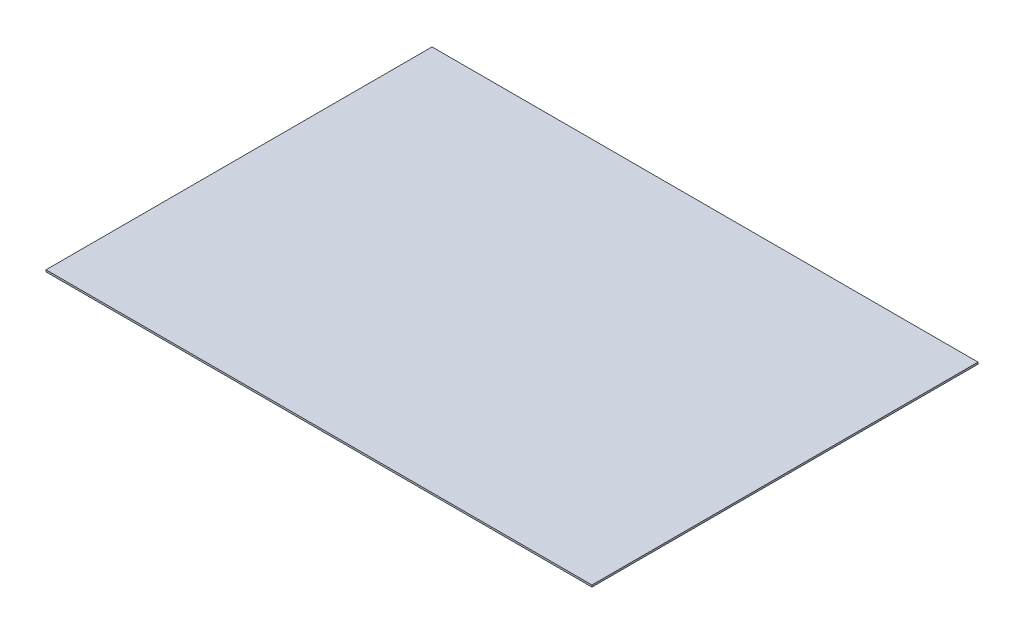
ISO-10303-21;
HEADER;
FILE_DESCRIPTION(('STEP AP214'),'2;1');
FILE_NAME('part.step','',(''),(''),'','','');
FILE_SCHEMA(('AUTOMOTIVE_DESIGN { 1 0 10303 214 1 1 1 1 }'));
ENDSEC;
DATA;
#1=APPLICATION_CONTEXT('core data for automotive mechanical design processes');
#2=APPLICATION_PROTOCOL_DEFINITION('international standard','automotive_design',2000,#1);
#3=PRODUCT_CONTEXT('',#1,'mechanical');
#4=PRODUCT('Part','Part','',(#3));
#5=PRODUCT_RELATED_PRODUCT_CATEGORY('part','',(#4));
#6=PRODUCT_DEFINITION_FORMATION('','',#4);
#7=PRODUCT_DEFINITION_CONTEXT('part definition',#1,'design');
#8=PRODUCT_DEFINITION('design','',#6,#7);
#9=PRODUCT_DEFINITION_SHAPE('','',#8);
#10=(LENGTH_UNIT() NAMED_UNIT(*) SI_UNIT(.MILLI.,.METRE.));
#11=(NAMED_UNIT(*) PLANE_ANGLE_UNIT() SI_UNIT($,.RADIAN.));
#12=(NAMED_UNIT(*) SI_UNIT($,.STERADIAN.) SOLID_ANGLE_UNIT());
#13=UNCERTAINTY_MEASURE_WITH_UNIT(LENGTH_MEASURE(1.E-05),#10,'distance_accuracy_value','');
#14=(GEOMETRIC_REPRESENTATION_CONTEXT(3) GLOBAL_UNCERTAINTY_ASSIGNED_CONTEXT((#13)) GLOBAL_UNIT_ASSIGNED_CONTEXT((#10,
#11,#12)) REPRESENTATION_CONTEXT('',''));
#15=CARTESIAN_POINT('',(0.,0.,0.));
#16=DIRECTION('',(0.,0.,1.));
#17=DIRECTION('',(1.,0.,0.));
#18=AXIS2_PLACEMENT_3D('',#15,#16,#17);
#19=CARTESIAN_POINT('',(-152.442477876106,1.,-93.0862831858407));
#20=DIRECTION('',(1.,0.,0.));
#21=DIRECTION('',(0.,0.,-1.));
#22=AXIS2_PLACEMENT_3D('',#19,#20,#21);
#23=PLANE('',#22);
#24=DIRECTION('',(0.,0.,1.));
#25=VECTOR('',#24,1.);
#26=CARTESIAN_POINT('',(-152.442477876106,0.,-93.0862831858407));
#27=LINE('',#26,#25);
#28=CARTESIAN_POINT('',(-152.442477876106,0.,-93.0862831858407));
#29=VERTEX_POINT('',#28);
#30=CARTESIAN_POINT('',(-152.442477876106,0.,116.913716814159));
#31=VERTEX_POINT('',#30);
#32=EDGE_CURVE('E95',#29,#31,#27,.T.);
#33=ORIENTED_EDGE('',*,*,#32,.T.);
#34=DIRECTION('',(0.,-1.,0.));
#35=VECTOR('',#34,1.);
#36=CARTESIAN_POINT('',(-152.442477876106,1.,116.913716814159));
#37=LINE('',#36,#35);
#38=CARTESIAN_POINT('',(-152.442477876106,1.,116.913716814159));
#39=VERTEX_POINT('',#38);
#40=EDGE_CURVE('E11',#39,#31,#37,.T.);
#41=ORIENTED_EDGE('',*,*,#40,.F.);
#42=DIRECTION('',(0.,0.,1.));
#43=VECTOR('',#42,1.);
#44=CARTESIAN_POINT('',(-152.442477876106,1.,-93.0862831858407));
#45=LINE('',#44,#43);
#46=CARTESIAN_POINT('',(-152.442477876106,1.,-93.0862831858407));
#47=VERTEX_POINT('',#46);
#48=EDGE_CURVE('E83',#47,#39,#45,.T.);
#49=ORIENTED_EDGE('',*,*,#48,.F.);
#50=DIRECTION('',(0.,-1.,0.));
#51=VECTOR('',#50,1.);
#52=CARTESIAN_POINT('',(-152.442477876106,1.,-93.0862831858407));
#53=LINE('',#52,#51);
#54=EDGE_CURVE('E91',#47,#29,#53,.T.);
#55=ORIENTED_EDGE('',*,*,#54,.T.);
#56=EDGE_LOOP('',(#33,#41,#49,#55));
#57=FACE_BOUND('',#56,.T.);
#58=ADVANCED_FACE('F32',(#57),#23,.F.);
#59=CARTESIAN_POINT('',(-152.442477876106,1.,116.913716814159));
#60=DIRECTION('',(0.,0.,-1.));
#61=DIRECTION('',(-1.,0.,0.));
#62=AXIS2_PLACEMENT_3D('',#59,#60,#61);
#63=PLANE('',#62);
#64=DIRECTION('',(1.,0.,0.));
#65=VECTOR('',#64,1.);
#66=CARTESIAN_POINT('',(-152.442477876106,0.,116.913716814159));
#67=LINE('',#66,#65);
#68=CARTESIAN_POINT('',(144.557522123894,0.,116.913716814159));
#69=VERTEX_POINT('',#68);
#70=EDGE_CURVE('E87',#31,#69,#67,.T.);
#71=ORIENTED_EDGE('',*,*,#70,.T.);
#72=DIRECTION('',(0.,-1.,0.));
#73=VECTOR('',#72,1.);
#74=CARTESIAN_POINT('',(144.557522123894,1.,116.913716814159));
#75=LINE('',#74,#73);
#76=CARTESIAN_POINT('',(144.557522123894,1.,116.913716814159));
#77=VERTEX_POINT('',#76);
#78=EDGE_CURVE('E40',#77,#69,#75,.T.);
#79=ORIENTED_EDGE('',*,*,#78,.F.);
#80=DIRECTION('',(1.,0.,0.));
#81=VECTOR('',#80,1.);
#82=CARTESIAN_POINT('',(-152.442477876106,1.,116.913716814159));
#83=LINE('',#82,#81);
#84=EDGE_CURVE('E78',#39,#77,#83,.T.);
#85=ORIENTED_EDGE('',*,*,#84,.F.);
#86=ORIENTED_EDGE('',*,*,#40,.T.);
#87=EDGE_LOOP('',(#71,#79,#85,#86));
#88=FACE_BOUND('',#87,.T.);
#89=ADVANCED_FACE('F86',(#88),#63,.F.);
#90=CARTESIAN_POINT('',(144.557522123894,1.,-93.0862831858407));
#91=DIRECTION('',(-1.,0.,0.));
#92=DIRECTION('',(0.,0.,1.));
#93=AXIS2_PLACEMENT_3D('',#90,#91,#92);
#94=PLANE('',#93);
#95=DIRECTION('',(0.,0.,-1.));
#96=VECTOR('',#95,1.);
#97=CARTESIAN_POINT('',(144.557522123894,0.,-93.0862831858407));
#98=LINE('',#97,#96);
#99=CARTESIAN_POINT('',(144.557522123894,0.,-93.0862831858407));
#100=VERTEX_POINT('',#99);
#101=EDGE_CURVE('E65',#69,#100,#98,.T.);
#102=ORIENTED_EDGE('',*,*,#101,.T.);
#103=DIRECTION('',(0.,-1.,0.));
#104=VECTOR('',#103,1.);
#105=CARTESIAN_POINT('',(144.557522123894,1.,-93.0862831858407));
#106=LINE('',#105,#104);
#107=CARTESIAN_POINT('',(144.557522123894,1.,-93.0862831858407));
#108=VERTEX_POINT('',#107);
#109=EDGE_CURVE('E88',#108,#100,#106,.T.);
#110=ORIENTED_EDGE('',*,*,#109,.F.);
#111=DIRECTION('',(0.,0.,-1.));
#112=VECTOR('',#111,1.);
#113=CARTESIAN_POINT('',(144.557522123894,1.,-93.0862831858407));
#114=LINE('',#113,#112);
#115=EDGE_CURVE('E81',#77,#108,#114,.T.);
#116=ORIENTED_EDGE('',*,*,#115,.F.);
#117=ORIENTED_EDGE('',*,*,#78,.T.);
#118=EDGE_LOOP('',(#102,#110,#116,#117));
#119=FACE_BOUND('',#118,.T.);
#120=ADVANCED_FACE('F89',(#119),#94,.F.);
#121=CARTESIAN_POINT('',(-152.442477876106,1.,-93.0862831858407));
#122=DIRECTION('',(0.,0.,1.));
#123=DIRECTION('',(1.,0.,0.));
#124=AXIS2_PLACEMENT_3D('',#121,#122,#123);
#125=PLANE('',#124);
#126=DIRECTION('',(-1.,0.,0.));
#127=VECTOR('',#126,1.);
#128=CARTESIAN_POINT('',(-152.442477876106,0.,-93.0862831858407));
#129=LINE('',#128,#127);
#130=EDGE_CURVE('E71',#100,#29,#129,.T.);
#131=ORIENTED_EDGE('',*,*,#130,.T.);
#132=ORIENTED_EDGE('',*,*,#54,.F.);
#133=DIRECTION('',(-1.,0.,0.));
#134=VECTOR('',#133,1.);
#135=CARTESIAN_POINT('',(-152.442477876106,1.,-93.0862831858407));
#136=LINE('',#135,#134);
#137=EDGE_CURVE('E48',#108,#47,#136,.T.);
#138=ORIENTED_EDGE('',*,*,#137,.F.);
#139=ORIENTED_EDGE('',*,*,#109,.T.);
#140=EDGE_LOOP('',(#131,#132,#138,#139));
#141=FACE_BOUND('',#140,.T.);
#142=ADVANCED_FACE('F102',(#141),#125,.F.);
#143=CARTESIAN_POINT('',(0.,1.,0.));
#144=DIRECTION('',(0.,1.,0.));
#145=DIRECTION('',(0.,0.,1.));
#146=AXIS2_PLACEMENT_3D('',#143,#144,#145);
#147=PLANE('',#146);
#148=ORIENTED_EDGE('',*,*,#48,.T.);
#149=ORIENTED_EDGE('',*,*,#84,.T.);
#150=ORIENTED_EDGE('',*,*,#115,.T.);
#151=ORIENTED_EDGE('',*,*,#137,.T.);
#152=EDGE_LOOP('',(#148,#149,#150,#151));
#153=FACE_BOUND('',#152,.T.);
#154=ADVANCED_FACE('F79',(#153),#147,.T.);
#155=CARTESIAN_POINT('',(0.,0.,0.));
#156=DIRECTION('',(0.,1.,0.));
#157=DIRECTION('',(0.,0.,1.));
#158=AXIS2_PLACEMENT_3D('',#155,#156,#157);
#159=PLANE('',#158);
#160=ORIENTED_EDGE('',*,*,#32,.F.);
#161=ORIENTED_EDGE('',*,*,#130,.F.);
#162=ORIENTED_EDGE('',*,*,#101,.F.);
#163=ORIENTED_EDGE('',*,*,#70,.F.);
#164=EDGE_LOOP('',(#160,#161,#162,#163));
#165=FACE_BOUND('',#164,.T.);
#166=ADVANCED_FACE('F105',(#165),#159,.F.);
#167=CLOSED_SHELL('',(#58,#89,#120,#142,#154,#166));
#168=MANIFOLD_SOLID_BREP('B2',#167);
#169=ADVANCED_BREP_SHAPE_REPRESENTATION('',(#18,#168),#14);
#170=SHAPE_DEFINITION_REPRESENTATION(#9,#169);
ENDSEC;
END-ISO-10303-21;
